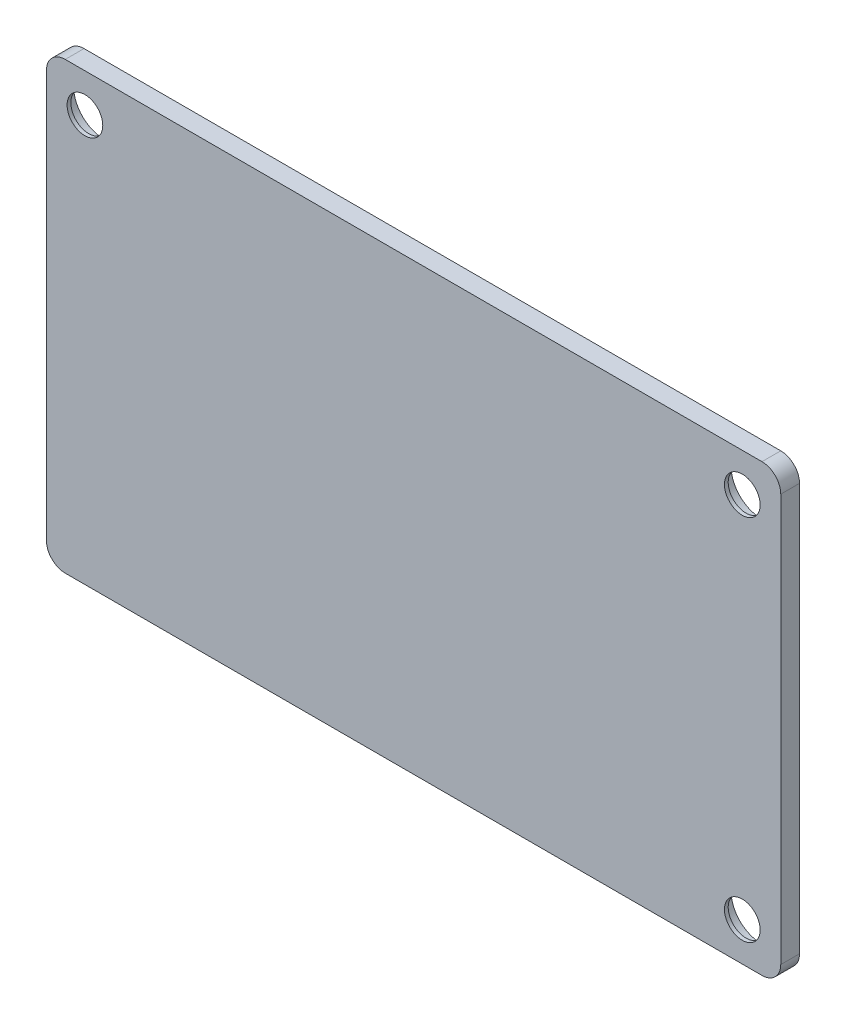
ISO-10303-21;
HEADER;
FILE_DESCRIPTION(('STEP AP214'),'2;1');
FILE_NAME('part.step','',(''),(''),'','','');
FILE_SCHEMA(('AUTOMOTIVE_DESIGN { 1 0 10303 214 1 1 1 1 }'));
ENDSEC;
DATA;
#1=APPLICATION_CONTEXT('core data for automotive mechanical design processes');
#2=APPLICATION_PROTOCOL_DEFINITION('international standard','automotive_design',2000,#1);
#3=PRODUCT_CONTEXT('',#1,'mechanical');
#4=PRODUCT('Part','Part','',(#3));
#5=PRODUCT_RELATED_PRODUCT_CATEGORY('part','',(#4));
#6=PRODUCT_DEFINITION_FORMATION('','',#4);
#7=PRODUCT_DEFINITION_CONTEXT('part definition',#1,'design');
#8=PRODUCT_DEFINITION('design','',#6,#7);
#9=PRODUCT_DEFINITION_SHAPE('','',#8);
#10=(LENGTH_UNIT() NAMED_UNIT(*) SI_UNIT(.MILLI.,.METRE.));
#11=(NAMED_UNIT(*) PLANE_ANGLE_UNIT() SI_UNIT($,.RADIAN.));
#12=(NAMED_UNIT(*) SI_UNIT($,.STERADIAN.) SOLID_ANGLE_UNIT());
#13=UNCERTAINTY_MEASURE_WITH_UNIT(LENGTH_MEASURE(1.E-05),#10,'distance_accuracy_value','');
#14=(GEOMETRIC_REPRESENTATION_CONTEXT(3) GLOBAL_UNCERTAINTY_ASSIGNED_CONTEXT((#13)) GLOBAL_UNIT_ASSIGNED_CONTEXT((#10,
#11,#12)) REPRESENTATION_CONTEXT('',''));
#15=CARTESIAN_POINT('',(0.,0.,0.));
#16=DIRECTION('',(0.,0.,1.));
#17=DIRECTION('',(1.,0.,0.));
#18=AXIS2_PLACEMENT_3D('',#15,#16,#17);
#19=CARTESIAN_POINT('',(0.,0.,0.));
#20=DIRECTION('',(0.,0.,1.));
#21=DIRECTION('',(1.,0.,0.));
#22=AXIS2_PLACEMENT_3D('',#19,#20,#21);
#23=PLANE('',#22);
#24=CARTESIAN_POINT('',(-42.105778396097,24.8858006252936,0.));
#25=DIRECTION('',(0.,0.,1.));
#26=DIRECTION('',(1.,0.,0.));
#27=AXIS2_PLACEMENT_3D('',#24,#25,#26);
#28=CIRCLE('',#27,4.05603409146846);
#29=CARTESIAN_POINT('',(-38.0497443046286,24.8858006252936,0.));
#30=VERTEX_POINT('',#29);
#31=EDGE_CURVE('E231',#30,#30,#28,.T.);
#32=ORIENTED_EDGE('',*,*,#31,.T.);
#33=EDGE_LOOP('',(#32));
#34=FACE_BOUND('',#33,.T.);
#35=CARTESIAN_POINT('',(46.794221603903,24.8858006252936,0.));
#36=DIRECTION('',(0.,0.,1.));
#37=DIRECTION('',(1.,0.,0.));
#38=AXIS2_PLACEMENT_3D('',#35,#36,#37);
#39=CIRCLE('',#38,4.05603409146846);
#40=CARTESIAN_POINT('',(50.8502556953714,24.8858006252936,0.));
#41=VERTEX_POINT('',#40);
#42=EDGE_CURVE('E215',#41,#41,#39,.F.);
#43=ORIENTED_EDGE('',*,*,#42,.F.);
#44=EDGE_LOOP('',(#43));
#45=FACE_BOUND('',#44,.T.);
#46=DIRECTION('',(0.,-1.,0.));
#47=VECTOR('',#46,1.);
#48=CARTESIAN_POINT('',(-47.3065790213906,0.,0.));
#49=LINE('',#48,#47);
#50=CARTESIAN_POINT('',(-47.3065790213906,27.5466012505874,0.));
#51=VERTEX_POINT('',#50);
#52=CARTESIAN_POINT('',(-47.3065790213906,-27.5466012505872,0.));
#53=VERTEX_POINT('',#52);
#54=EDGE_CURVE('E147',#51,#53,#49,.T.);
#55=ORIENTED_EDGE('',*,*,#54,.F.);
#56=CARTESIAN_POINT('',(-44.7665790213906,27.5466012505874,0.));
#57=DIRECTION('',(0.,0.,1.));
#58=DIRECTION('',(1.,0.,0.));
#59=AXIS2_PLACEMENT_3D('',#56,#57,#58);
#60=CIRCLE('',#59,2.54);
#61=CARTESIAN_POINT('',(-44.7665790213906,30.0866012505874,0.));
#62=VERTEX_POINT('',#61);
#63=EDGE_CURVE('E130',#51,#62,#60,.F.);
#64=ORIENTED_EDGE('',*,*,#63,.T.);
#65=DIRECTION('',(-1.,0.,0.));
#66=VECTOR('',#65,1.);
#67=CARTESIAN_POINT('',(0.,30.0866012505873,0.));
#68=LINE('',#67,#66);
#69=CARTESIAN_POINT('',(49.4550222291967,30.0866012505872,0.));
#70=VERTEX_POINT('',#69);
#71=EDGE_CURVE('E170',#70,#62,#68,.T.);
#72=ORIENTED_EDGE('',*,*,#71,.F.);
#73=CARTESIAN_POINT('',(49.4550222291967,27.5466012505872,0.));
#74=DIRECTION('',(0.,0.,1.));
#75=DIRECTION('',(1.,0.,0.));
#76=AXIS2_PLACEMENT_3D('',#73,#74,#75);
#77=CIRCLE('',#76,2.54);
#78=CARTESIAN_POINT('',(51.9950222291967,27.5466012505872,0.));
#79=VERTEX_POINT('',#78);
#80=EDGE_CURVE('E151',#70,#79,#77,.F.);
#81=ORIENTED_EDGE('',*,*,#80,.T.);
#82=DIRECTION('',(0.,1.,0.));
#83=VECTOR('',#82,1.);
#84=CARTESIAN_POINT('',(51.9950222291966,0.,0.));
#85=LINE('',#84,#83);
#86=CARTESIAN_POINT('',(51.9950222291966,-27.5466012505874,0.));
#87=VERTEX_POINT('',#86);
#88=EDGE_CURVE('E160',#87,#79,#85,.T.);
#89=ORIENTED_EDGE('',*,*,#88,.F.);
#90=CARTESIAN_POINT('',(49.4550222291966,-27.5466012505874,0.));
#91=DIRECTION('',(0.,0.,1.));
#92=DIRECTION('',(1.,0.,0.));
#93=AXIS2_PLACEMENT_3D('',#90,#91,#92);
#94=CIRCLE('',#93,2.54);
#95=CARTESIAN_POINT('',(49.4550222291966,-30.0866012505874,0.));
#96=VERTEX_POINT('',#95);
#97=EDGE_CURVE('E174',#87,#96,#94,.F.);
#98=ORIENTED_EDGE('',*,*,#97,.T.);
#99=DIRECTION('',(1.,0.,0.));
#100=VECTOR('',#99,1.);
#101=CARTESIAN_POINT('',(0.,-30.0866012505873,0.));
#102=LINE('',#101,#100);
#103=CARTESIAN_POINT('',(-44.7665790213906,-30.0866012505872,0.));
#104=VERTEX_POINT('',#103);
#105=EDGE_CURVE('E156',#104,#96,#102,.T.);
#106=ORIENTED_EDGE('',*,*,#105,.F.);
#107=CARTESIAN_POINT('',(-44.7665790213906,-27.5466012505872,0.));
#108=DIRECTION('',(0.,0.,1.));
#109=DIRECTION('',(1.,0.,0.));
#110=AXIS2_PLACEMENT_3D('',#107,#108,#109);
#111=CIRCLE('',#110,2.54);
#112=EDGE_CURVE('E141',#104,#53,#111,.F.);
#113=ORIENTED_EDGE('',*,*,#112,.T.);
#114=EDGE_LOOP('',(#55,#64,#72,#81,#89,#98,#106,#113));
#115=FACE_BOUND('',#114,.T.);
#116=CARTESIAN_POINT('',(46.794221603903,-24.8858006252936,0.));
#117=DIRECTION('',(0.,0.,1.));
#118=DIRECTION('',(1.,0.,0.));
#119=AXIS2_PLACEMENT_3D('',#116,#117,#118);
#120=CIRCLE('',#119,4.05603409146846);
#121=CARTESIAN_POINT('',(50.8502556953714,-24.8858006252936,0.));
#122=VERTEX_POINT('',#121);
#123=EDGE_CURVE('E224',#122,#122,#120,.T.);
#124=ORIENTED_EDGE('',*,*,#123,.T.);
#125=EDGE_LOOP('',(#124));
#126=FACE_BOUND('',#125,.T.);
#127=ADVANCED_FACE('F64',(#34,#45,#115,#126),#23,.F.);
#128=CARTESIAN_POINT('',(0.,0.,2.54));
#129=DIRECTION('',(0.,0.,1.));
#130=DIRECTION('',(1.,0.,0.));
#131=AXIS2_PLACEMENT_3D('',#128,#129,#130);
#132=PLANE('',#131);
#133=CARTESIAN_POINT('',(46.794221603903,-24.8858006252936,2.54));
#134=DIRECTION('',(0.,0.,1.));
#135=DIRECTION('',(1.,0.,0.));
#136=AXIS2_PLACEMENT_3D('',#133,#134,#135);
#137=CIRCLE('',#136,2.413);
#138=CARTESIAN_POINT('',(49.207221603903,-24.8858006252936,2.54));
#139=VERTEX_POINT('',#138);
#140=EDGE_CURVE('E166',#139,#139,#137,.T.);
#141=ORIENTED_EDGE('',*,*,#140,.F.);
#142=EDGE_LOOP('',(#141));
#143=FACE_BOUND('',#142,.T.);
#144=DIRECTION('',(-1.,0.,0.));
#145=VECTOR('',#144,1.);
#146=CARTESIAN_POINT('',(0.,30.0866012505873,2.54));
#147=LINE('',#146,#145);
#148=CARTESIAN_POINT('',(49.4550222291967,30.0866012505872,2.54));
#149=VERTEX_POINT('',#148);
#150=CARTESIAN_POINT('',(-44.7665790213906,30.0866012505874,2.54));
#151=VERTEX_POINT('',#150);
#152=EDGE_CURVE('E206',#149,#151,#147,.T.);
#153=ORIENTED_EDGE('',*,*,#152,.T.);
#154=CARTESIAN_POINT('',(-44.7665790213906,27.5466012505874,2.54));
#155=DIRECTION('',(0.,0.,1.));
#156=DIRECTION('',(1.,0.,0.));
#157=AXIS2_PLACEMENT_3D('',#154,#155,#156);
#158=CIRCLE('',#157,2.54);
#159=CARTESIAN_POINT('',(-47.3065790213906,27.5466012505874,2.54));
#160=VERTEX_POINT('',#159);
#161=EDGE_CURVE('E185',#151,#160,#158,.T.);
#162=ORIENTED_EDGE('',*,*,#161,.T.);
#163=DIRECTION('',(0.,-1.,0.));
#164=VECTOR('',#163,1.);
#165=CARTESIAN_POINT('',(-47.3065790213906,0.,2.54));
#166=LINE('',#165,#164);
#167=CARTESIAN_POINT('',(-47.3065790213906,-27.5466012505872,2.54));
#168=VERTEX_POINT('',#167);
#169=EDGE_CURVE('E150',#160,#168,#166,.T.);
#170=ORIENTED_EDGE('',*,*,#169,.T.);
#171=CARTESIAN_POINT('',(-44.7665790213906,-27.5466012505872,2.54));
#172=DIRECTION('',(0.,0.,1.));
#173=DIRECTION('',(1.,0.,0.));
#174=AXIS2_PLACEMENT_3D('',#171,#172,#173);
#175=CIRCLE('',#174,2.54);
#176=CARTESIAN_POINT('',(-44.7665790213906,-30.0866012505872,2.54));
#177=VERTEX_POINT('',#176);
#178=EDGE_CURVE('E183',#168,#177,#175,.T.);
#179=ORIENTED_EDGE('',*,*,#178,.T.);
#180=DIRECTION('',(1.,0.,0.));
#181=VECTOR('',#180,1.);
#182=CARTESIAN_POINT('',(0.,-30.0866012505873,2.54));
#183=LINE('',#182,#181);
#184=CARTESIAN_POINT('',(49.4550222291966,-30.0866012505874,2.54));
#185=VERTEX_POINT('',#184);
#186=EDGE_CURVE('E196',#177,#185,#183,.T.);
#187=ORIENTED_EDGE('',*,*,#186,.T.);
#188=CARTESIAN_POINT('',(49.4550222291966,-27.5466012505874,2.54));
#189=DIRECTION('',(0.,0.,1.));
#190=DIRECTION('',(1.,0.,0.));
#191=AXIS2_PLACEMENT_3D('',#188,#189,#190);
#192=CIRCLE('',#191,2.54);
#193=CARTESIAN_POINT('',(51.9950222291966,-27.5466012505874,2.54));
#194=VERTEX_POINT('',#193);
#195=EDGE_CURVE('E85',#185,#194,#192,.T.);
#196=ORIENTED_EDGE('',*,*,#195,.T.);
#197=DIRECTION('',(0.,1.,0.));
#198=VECTOR('',#197,1.);
#199=CARTESIAN_POINT('',(51.9950222291966,0.,2.54));
#200=LINE('',#199,#198);
#201=CARTESIAN_POINT('',(51.9950222291967,27.5466012505872,2.54));
#202=VERTEX_POINT('',#201);
#203=EDGE_CURVE('E204',#194,#202,#200,.T.);
#204=ORIENTED_EDGE('',*,*,#203,.T.);
#205=CARTESIAN_POINT('',(49.4550222291967,27.5466012505872,2.54));
#206=DIRECTION('',(0.,0.,1.));
#207=DIRECTION('',(1.,0.,0.));
#208=AXIS2_PLACEMENT_3D('',#205,#206,#207);
#209=CIRCLE('',#208,2.54);
#210=EDGE_CURVE('E180',#202,#149,#209,.T.);
#211=ORIENTED_EDGE('',*,*,#210,.T.);
#212=EDGE_LOOP('',(#153,#162,#170,#179,#187,#196,#204,#211));
#213=FACE_BOUND('',#212,.T.);
#214=CARTESIAN_POINT('',(46.794221603903,24.8858006252936,2.54));
#215=DIRECTION('',(0.,0.,1.));
#216=DIRECTION('',(1.,0.,0.));
#217=AXIS2_PLACEMENT_3D('',#214,#215,#216);
#218=CIRCLE('',#217,2.413);
#219=CARTESIAN_POINT('',(49.207221603903,24.8858006252936,2.54));
#220=VERTEX_POINT('',#219);
#221=EDGE_CURVE('E157',#220,#220,#218,.F.);
#222=ORIENTED_EDGE('',*,*,#221,.T.);
#223=EDGE_LOOP('',(#222));
#224=FACE_BOUND('',#223,.T.);
#225=CARTESIAN_POINT('',(-42.105778396097,24.8858006252936,2.54));
#226=DIRECTION('',(0.,0.,1.));
#227=DIRECTION('',(1.,0.,0.));
#228=AXIS2_PLACEMENT_3D('',#225,#226,#227);
#229=CIRCLE('',#228,2.413);
#230=CARTESIAN_POINT('',(-39.692778396097,24.8858006252936,2.54));
#231=VERTEX_POINT('',#230);
#232=EDGE_CURVE('E163',#231,#231,#229,.T.);
#233=ORIENTED_EDGE('',*,*,#232,.F.);
#234=EDGE_LOOP('',(#233));
#235=FACE_BOUND('',#234,.T.);
#236=ADVANCED_FACE('F253',(#143,#213,#224,#235),#132,.T.);
#237=CARTESIAN_POINT('',(46.794221603903,-24.8858006252936,2.54));
#238=DIRECTION('',(0.,0.,-1.));
#239=DIRECTION('',(-1.,0.,0.));
#240=AXIS2_PLACEMENT_3D('',#237,#238,#239);
#241=CYLINDRICAL_SURFACE('',#240,2.413);
#242=CARTESIAN_POINT('',(46.794221603903,-24.8858006252936,2.032));
#243=DIRECTION('',(0.,0.,1.));
#244=DIRECTION('',(1.,0.,0.));
#245=AXIS2_PLACEMENT_3D('',#242,#243,#244);
#246=CIRCLE('',#245,2.413);
#247=CARTESIAN_POINT('',(49.207221603903,-24.8858006252936,2.032));
#248=VERTEX_POINT('',#247);
#249=EDGE_CURVE('E227',#248,#248,#246,.T.);
#250=ORIENTED_EDGE('',*,*,#249,.F.);
#251=EDGE_LOOP('',(#250));
#252=FACE_BOUND('',#251,.T.);
#253=ORIENTED_EDGE('',*,*,#140,.T.);
#254=EDGE_LOOP('',(#253));
#255=FACE_BOUND('',#254,.T.);
#256=ADVANCED_FACE('F255',(#252,#255),#241,.F.);
#257=CARTESIAN_POINT('',(0.,-30.0866012505873,2.54));
#258=DIRECTION('',(0.,1.,0.));
#259=DIRECTION('',(-1.,0.,0.));
#260=AXIS2_PLACEMENT_3D('',#257,#258,#259);
#261=PLANE('',#260);
#262=ORIENTED_EDGE('',*,*,#186,.F.);
#263=DIRECTION('',(0.,0.,-1.));
#264=VECTOR('',#263,1.);
#265=CARTESIAN_POINT('',(-44.7665790213906,-30.0866012505872,2.54));
#266=LINE('',#265,#264);
#267=EDGE_CURVE('E189',#177,#104,#266,.T.);
#268=ORIENTED_EDGE('',*,*,#267,.T.);
#269=ORIENTED_EDGE('',*,*,#105,.T.);
#270=DIRECTION('',(0.,0.,-1.));
#271=VECTOR('',#270,1.);
#272=CARTESIAN_POINT('',(49.4550222291966,-30.0866012505874,2.54));
#273=LINE('',#272,#271);
#274=EDGE_CURVE('E187',#96,#185,#273,.F.);
#275=ORIENTED_EDGE('',*,*,#274,.T.);
#276=EDGE_LOOP('',(#262,#268,#269,#275));
#277=FACE_BOUND('',#276,.T.);
#278=ADVANCED_FACE('F194',(#277),#261,.F.);
#279=CARTESIAN_POINT('',(51.9950222291966,0.,2.54));
#280=DIRECTION('',(-1.,0.,0.));
#281=DIRECTION('',(0.,-1.,0.));
#282=AXIS2_PLACEMENT_3D('',#279,#280,#281);
#283=PLANE('',#282);
#284=ORIENTED_EDGE('',*,*,#203,.F.);
#285=DIRECTION('',(0.,0.,-1.));
#286=VECTOR('',#285,1.);
#287=CARTESIAN_POINT('',(51.9950222291966,-27.5466012505874,2.54));
#288=LINE('',#287,#286);
#289=EDGE_CURVE('E12',#194,#87,#288,.T.);
#290=ORIENTED_EDGE('',*,*,#289,.T.);
#291=ORIENTED_EDGE('',*,*,#88,.T.);
#292=DIRECTION('',(0.,0.,-1.));
#293=VECTOR('',#292,1.);
#294=CARTESIAN_POINT('',(51.9950222291967,27.5466012505872,2.54));
#295=LINE('',#294,#293);
#296=EDGE_CURVE('E72',#79,#202,#295,.F.);
#297=ORIENTED_EDGE('',*,*,#296,.T.);
#298=EDGE_LOOP('',(#284,#290,#291,#297));
#299=FACE_BOUND('',#298,.T.);
#300=ADVANCED_FACE('F203',(#299),#283,.F.);
#301=CARTESIAN_POINT('',(0.,30.0866012505873,2.54));
#302=DIRECTION('',(0.,-1.,0.));
#303=DIRECTION('',(1.,0.,0.));
#304=AXIS2_PLACEMENT_3D('',#301,#302,#303);
#305=PLANE('',#304);
#306=ORIENTED_EDGE('',*,*,#71,.T.);
#307=DIRECTION('',(0.,0.,-1.));
#308=VECTOR('',#307,1.);
#309=CARTESIAN_POINT('',(-44.7665790213906,30.0866012505874,2.54));
#310=LINE('',#309,#308);
#311=EDGE_CURVE('E135',#62,#151,#310,.F.);
#312=ORIENTED_EDGE('',*,*,#311,.T.);
#313=ORIENTED_EDGE('',*,*,#152,.F.);
#314=DIRECTION('',(0.,0.,-1.));
#315=VECTOR('',#314,1.);
#316=CARTESIAN_POINT('',(49.4550222291967,30.0866012505872,2.54));
#317=LINE('',#316,#315);
#318=EDGE_CURVE('E140',#149,#70,#317,.T.);
#319=ORIENTED_EDGE('',*,*,#318,.T.);
#320=EDGE_LOOP('',(#306,#312,#313,#319));
#321=FACE_BOUND('',#320,.T.);
#322=ADVANCED_FACE('F269',(#321),#305,.F.);
#323=CARTESIAN_POINT('',(-47.3065790213906,0.,2.54));
#324=DIRECTION('',(1.,0.,0.));
#325=DIRECTION('',(0.,0.,-1.));
#326=AXIS2_PLACEMENT_3D('',#323,#324,#325);
#327=PLANE('',#326);
#328=ORIENTED_EDGE('',*,*,#169,.F.);
#329=DIRECTION('',(0.,0.,-1.));
#330=VECTOR('',#329,1.);
#331=CARTESIAN_POINT('',(-47.3065790213906,27.5466012505874,2.54));
#332=LINE('',#331,#330);
#333=EDGE_CURVE('E134',#160,#51,#332,.T.);
#334=ORIENTED_EDGE('',*,*,#333,.T.);
#335=ORIENTED_EDGE('',*,*,#54,.T.);
#336=DIRECTION('',(0.,0.,-1.));
#337=VECTOR('',#336,1.);
#338=CARTESIAN_POINT('',(-47.3065790213906,-27.5466012505872,2.54));
#339=LINE('',#338,#337);
#340=EDGE_CURVE('E152',#53,#168,#339,.F.);
#341=ORIENTED_EDGE('',*,*,#340,.T.);
#342=EDGE_LOOP('',(#328,#334,#335,#341));
#343=FACE_BOUND('',#342,.T.);
#344=ADVANCED_FACE('F146',(#343),#327,.F.);
#345=CARTESIAN_POINT('',(46.794221603903,24.8858006252936,2.54));
#346=DIRECTION('',(0.,0.,-1.));
#347=DIRECTION('',(-1.,0.,0.));
#348=AXIS2_PLACEMENT_3D('',#345,#346,#347);
#349=CYLINDRICAL_SURFACE('',#348,2.413);
#350=CARTESIAN_POINT('',(46.794221603903,24.8858006252936,2.032));
#351=DIRECTION('',(0.,0.,1.));
#352=DIRECTION('',(1.,0.,0.));
#353=AXIS2_PLACEMENT_3D('',#350,#351,#352);
#354=CIRCLE('',#353,2.413);
#355=CARTESIAN_POINT('',(49.207221603903,24.8858006252936,2.032));
#356=VERTEX_POINT('',#355);
#357=EDGE_CURVE('E214',#356,#356,#354,.F.);
#358=ORIENTED_EDGE('',*,*,#357,.T.);
#359=EDGE_LOOP('',(#358));
#360=FACE_BOUND('',#359,.T.);
#361=ORIENTED_EDGE('',*,*,#221,.F.);
#362=EDGE_LOOP('',(#361));
#363=FACE_BOUND('',#362,.T.);
#364=ADVANCED_FACE('F249',(#360,#363),#349,.F.);
#365=CARTESIAN_POINT('',(-42.105778396097,24.8858006252936,2.54));
#366=DIRECTION('',(0.,0.,-1.));
#367=DIRECTION('',(-1.,0.,0.));
#368=AXIS2_PLACEMENT_3D('',#365,#366,#367);
#369=CYLINDRICAL_SURFACE('',#368,2.413);
#370=CARTESIAN_POINT('',(-42.105778396097,24.8858006252936,2.032));
#371=DIRECTION('',(0.,0.,1.));
#372=DIRECTION('',(1.,0.,0.));
#373=AXIS2_PLACEMENT_3D('',#370,#371,#372);
#374=CIRCLE('',#373,2.413);
#375=CARTESIAN_POINT('',(-39.692778396097,24.8858006252936,2.032));
#376=VERTEX_POINT('',#375);
#377=EDGE_CURVE('E236',#376,#376,#374,.T.);
#378=ORIENTED_EDGE('',*,*,#377,.F.);
#379=EDGE_LOOP('',(#378));
#380=FACE_BOUND('',#379,.T.);
#381=ORIENTED_EDGE('',*,*,#232,.T.);
#382=EDGE_LOOP('',(#381));
#383=FACE_BOUND('',#382,.T.);
#384=ADVANCED_FACE('F245',(#380,#383),#369,.F.);
#385=CARTESIAN_POINT('',(-42.105778396097,24.8858006252936,2.032));
#386=DIRECTION('',(0.,0.,-1.));
#387=DIRECTION('',(-1.,0.,0.));
#388=AXIS2_PLACEMENT_3D('',#385,#386,#387);
#389=CYLINDRICAL_SURFACE('',#388,4.05603409146846);
#390=CARTESIAN_POINT('',(-42.105778396097,24.8858006252936,2.032));
#391=DIRECTION('',(0.,0.,1.));
#392=DIRECTION('',(1.,0.,0.));
#393=AXIS2_PLACEMENT_3D('',#390,#391,#392);
#394=CIRCLE('',#393,4.05603409146846);
#395=CARTESIAN_POINT('',(-38.0497443046286,24.8858006252936,2.032));
#396=VERTEX_POINT('',#395);
#397=EDGE_CURVE('E219',#396,#396,#394,.T.);
#398=ORIENTED_EDGE('',*,*,#397,.T.);
#399=EDGE_LOOP('',(#398));
#400=FACE_BOUND('',#399,.T.);
#401=ORIENTED_EDGE('',*,*,#31,.F.);
#402=EDGE_LOOP('',(#401));
#403=FACE_BOUND('',#402,.T.);
#404=ADVANCED_FACE('F248',(#400,#403),#389,.F.);
#405=CARTESIAN_POINT('',(0.,0.,2.032));
#406=DIRECTION('',(0.,0.,1.));
#407=DIRECTION('',(1.,0.,0.));
#408=AXIS2_PLACEMENT_3D('',#405,#406,#407);
#409=PLANE('',#408);
#410=ORIENTED_EDGE('',*,*,#377,.T.);
#411=EDGE_LOOP('',(#410));
#412=FACE_BOUND('',#411,.T.);
#413=ORIENTED_EDGE('',*,*,#397,.F.);
#414=EDGE_LOOP('',(#413));
#415=FACE_BOUND('',#414,.T.);
#416=ADVANCED_FACE('F242',(#412,#415),#409,.F.);
#417=CARTESIAN_POINT('',(46.794221603903,24.8858006252936,2.032));
#418=DIRECTION('',(0.,0.,-1.));
#419=DIRECTION('',(-1.,0.,0.));
#420=AXIS2_PLACEMENT_3D('',#417,#418,#419);
#421=CYLINDRICAL_SURFACE('',#420,4.05603409146846);
#422=CARTESIAN_POINT('',(46.794221603903,24.8858006252936,2.032));
#423=DIRECTION('',(0.,0.,1.));
#424=DIRECTION('',(1.,0.,0.));
#425=AXIS2_PLACEMENT_3D('',#422,#423,#424);
#426=CIRCLE('',#425,4.05603409146846);
#427=CARTESIAN_POINT('',(50.8502556953714,24.8858006252936,2.032));
#428=VERTEX_POINT('',#427);
#429=EDGE_CURVE('E218',#428,#428,#426,.F.);
#430=ORIENTED_EDGE('',*,*,#429,.F.);
#431=EDGE_LOOP('',(#430));
#432=FACE_BOUND('',#431,.T.);
#433=ORIENTED_EDGE('',*,*,#42,.T.);
#434=EDGE_LOOP('',(#433));
#435=FACE_BOUND('',#434,.T.);
#436=ADVANCED_FACE('F305',(#432,#435),#421,.F.);
#437=CARTESIAN_POINT('',(0.,0.,2.032));
#438=DIRECTION('',(0.,0.,1.));
#439=DIRECTION('',(1.,0.,0.));
#440=AXIS2_PLACEMENT_3D('',#437,#438,#439);
#441=PLANE('',#440);
#442=ORIENTED_EDGE('',*,*,#429,.T.);
#443=EDGE_LOOP('',(#442));
#444=FACE_BOUND('',#443,.T.);
#445=ORIENTED_EDGE('',*,*,#357,.F.);
#446=EDGE_LOOP('',(#445));
#447=FACE_BOUND('',#446,.T.);
#448=ADVANCED_FACE('F302',(#444,#447),#441,.F.);
#449=CARTESIAN_POINT('',(46.794221603903,-24.8858006252936,2.032));
#450=DIRECTION('',(0.,0.,-1.));
#451=DIRECTION('',(-1.,0.,0.));
#452=AXIS2_PLACEMENT_3D('',#449,#450,#451);
#453=CYLINDRICAL_SURFACE('',#452,4.05603409146846);
#454=CARTESIAN_POINT('',(46.794221603903,-24.8858006252936,2.032));
#455=DIRECTION('',(0.,0.,1.));
#456=DIRECTION('',(1.,0.,0.));
#457=AXIS2_PLACEMENT_3D('',#454,#455,#456);
#458=CIRCLE('',#457,4.05603409146846);
#459=CARTESIAN_POINT('',(50.8502556953714,-24.8858006252936,2.032));
#460=VERTEX_POINT('',#459);
#461=EDGE_CURVE('E228',#460,#460,#458,.T.);
#462=ORIENTED_EDGE('',*,*,#461,.T.);
#463=EDGE_LOOP('',(#462));
#464=FACE_BOUND('',#463,.T.);
#465=ORIENTED_EDGE('',*,*,#123,.F.);
#466=EDGE_LOOP('',(#465));
#467=FACE_BOUND('',#466,.T.);
#468=ADVANCED_FACE('F304',(#464,#467),#453,.F.);
#469=CARTESIAN_POINT('',(0.,0.,2.032));
#470=DIRECTION('',(0.,0.,1.));
#471=DIRECTION('',(1.,0.,0.));
#472=AXIS2_PLACEMENT_3D('',#469,#470,#471);
#473=PLANE('',#472);
#474=ORIENTED_EDGE('',*,*,#249,.T.);
#475=EDGE_LOOP('',(#474));
#476=FACE_BOUND('',#475,.T.);
#477=ORIENTED_EDGE('',*,*,#461,.F.);
#478=EDGE_LOOP('',(#477));
#479=FACE_BOUND('',#478,.T.);
#480=ADVANCED_FACE('F282',(#476,#479),#473,.F.);
#481=CARTESIAN_POINT('',(-44.7665790213906,27.5466012505874,2.54));
#482=DIRECTION('',(0.,0.,-1.));
#483=DIRECTION('',(-1.,0.,0.));
#484=AXIS2_PLACEMENT_3D('',#481,#482,#483);
#485=CYLINDRICAL_SURFACE('',#484,2.54);
#486=ORIENTED_EDGE('',*,*,#161,.F.);
#487=ORIENTED_EDGE('',*,*,#311,.F.);
#488=ORIENTED_EDGE('',*,*,#63,.F.);
#489=ORIENTED_EDGE('',*,*,#333,.F.);
#490=EDGE_LOOP('',(#486,#487,#488,#489));
#491=FACE_BOUND('',#490,.T.);
#492=ADVANCED_FACE('F133',(#491),#485,.T.);
#493=CARTESIAN_POINT('',(-44.7665790213906,-27.5466012505872,2.54));
#494=DIRECTION('',(0.,0.,-1.));
#495=DIRECTION('',(-1.,0.,0.));
#496=AXIS2_PLACEMENT_3D('',#493,#494,#495);
#497=CYLINDRICAL_SURFACE('',#496,2.54);
#498=ORIENTED_EDGE('',*,*,#178,.F.);
#499=ORIENTED_EDGE('',*,*,#340,.F.);
#500=ORIENTED_EDGE('',*,*,#112,.F.);
#501=ORIENTED_EDGE('',*,*,#267,.F.);
#502=EDGE_LOOP('',(#498,#499,#500,#501));
#503=FACE_BOUND('',#502,.T.);
#504=ADVANCED_FACE('F281',(#503),#497,.T.);
#505=CARTESIAN_POINT('',(49.4550222291966,-27.5466012505874,2.54));
#506=DIRECTION('',(0.,0.,-1.));
#507=DIRECTION('',(-1.,0.,0.));
#508=AXIS2_PLACEMENT_3D('',#505,#506,#507);
#509=CYLINDRICAL_SURFACE('',#508,2.54);
#510=ORIENTED_EDGE('',*,*,#195,.F.);
#511=ORIENTED_EDGE('',*,*,#274,.F.);
#512=ORIENTED_EDGE('',*,*,#97,.F.);
#513=ORIENTED_EDGE('',*,*,#289,.F.);
#514=EDGE_LOOP('',(#510,#511,#512,#513));
#515=FACE_BOUND('',#514,.T.);
#516=ADVANCED_FACE('F202',(#515),#509,.T.);
#517=CARTESIAN_POINT('',(49.4550222291967,27.5466012505872,2.54));
#518=DIRECTION('',(0.,0.,-1.));
#519=DIRECTION('',(-1.,0.,0.));
#520=AXIS2_PLACEMENT_3D('',#517,#518,#519);
#521=CYLINDRICAL_SURFACE('',#520,2.54);
#522=ORIENTED_EDGE('',*,*,#210,.F.);
#523=ORIENTED_EDGE('',*,*,#296,.F.);
#524=ORIENTED_EDGE('',*,*,#80,.F.);
#525=ORIENTED_EDGE('',*,*,#318,.F.);
#526=EDGE_LOOP('',(#522,#523,#524,#525));
#527=FACE_BOUND('',#526,.T.);
#528=ADVANCED_FACE('F66',(#527),#521,.T.);
#529=CLOSED_SHELL('',(#127,#236,#256,#278,#300,#322,#344,#364,#384,#404,#416,#436,#448,#468,
#480,#492,#504,#516,#528));
#530=MANIFOLD_SOLID_BREP('B2',#529);
#531=ADVANCED_BREP_SHAPE_REPRESENTATION('',(#18,#530),#14);
#532=SHAPE_DEFINITION_REPRESENTATION(#9,#531);
ENDSEC;
END-ISO-10303-21;
